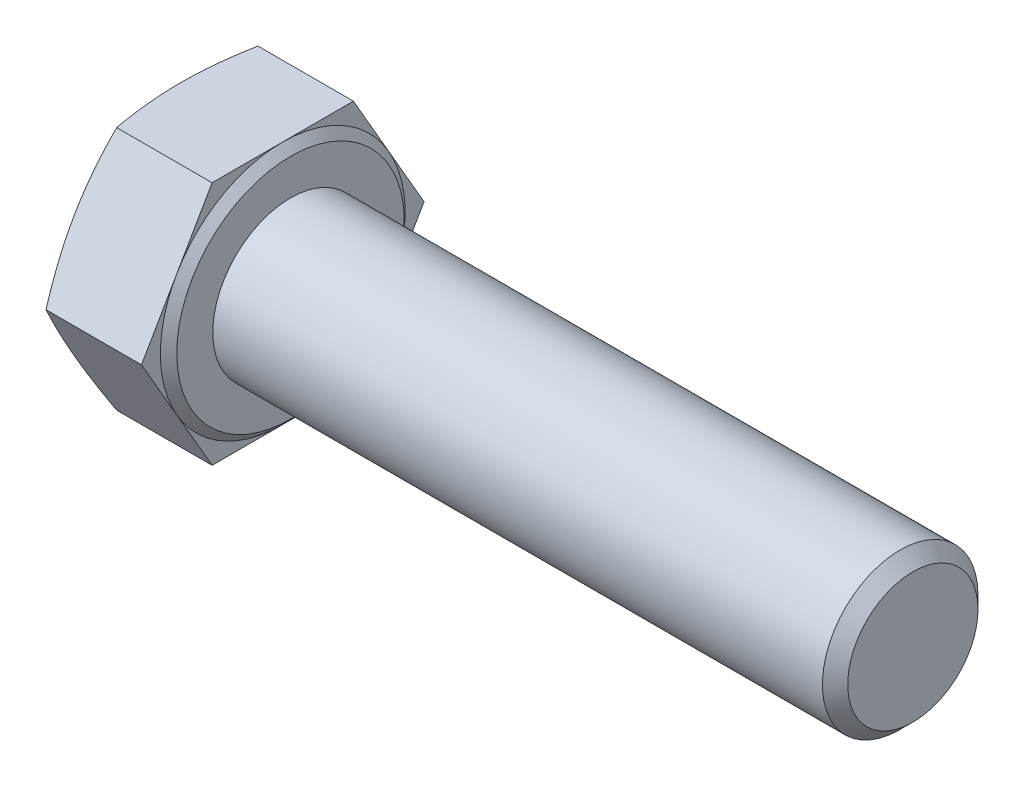
ISO-10303-21;
HEADER;
FILE_DESCRIPTION(('STEP AP214'),'2;1');
FILE_NAME('part.step','',(''),(''),'','','');
FILE_SCHEMA(('AUTOMOTIVE_DESIGN { 1 0 10303 214 1 1 1 1 }'));
ENDSEC;
DATA;
#1=APPLICATION_CONTEXT('core data for automotive mechanical design processes');
#2=APPLICATION_PROTOCOL_DEFINITION('international standard','automotive_design',2000,#1);
#3=PRODUCT_CONTEXT('',#1,'mechanical');
#4=PRODUCT('Part','Part','',(#3));
#5=PRODUCT_RELATED_PRODUCT_CATEGORY('part','',(#4));
#6=PRODUCT_DEFINITION_FORMATION('','',#4);
#7=PRODUCT_DEFINITION_CONTEXT('part definition',#1,'design');
#8=PRODUCT_DEFINITION('design','',#6,#7);
#9=PRODUCT_DEFINITION_SHAPE('','',#8);
#10=(LENGTH_UNIT() NAMED_UNIT(*) SI_UNIT(.MILLI.,.METRE.));
#11=(NAMED_UNIT(*) PLANE_ANGLE_UNIT() SI_UNIT($,.RADIAN.));
#12=(NAMED_UNIT(*) SI_UNIT($,.STERADIAN.) SOLID_ANGLE_UNIT());
#13=UNCERTAINTY_MEASURE_WITH_UNIT(LENGTH_MEASURE(1.E-05),#10,'distance_accuracy_value','');
#14=(GEOMETRIC_REPRESENTATION_CONTEXT(3) GLOBAL_UNCERTAINTY_ASSIGNED_CONTEXT((#13)) GLOBAL_UNIT_ASSIGNED_CONTEXT((#10,
#11,#12)) REPRESENTATION_CONTEXT('',''));
#15=CARTESIAN_POINT('',(0.,0.,0.));
#16=DIRECTION('',(0.,0.,1.));
#17=DIRECTION('',(1.,0.,0.));
#18=AXIS2_PLACEMENT_3D('',#15,#16,#17);
#19=CARTESIAN_POINT('',(7.08,0.,0.));
#20=DIRECTION('',(1.,0.,0.));
#21=DIRECTION('',(0.,0.,-1.));
#22=AXIS2_PLACEMENT_3D('',#19,#20,#21);
#23=PLANE('',#22);
#24=CARTESIAN_POINT('',(7.08,0.,0.));
#25=DIRECTION('',(-1.,0.,0.));
#26=DIRECTION('',(0.,0.,1.));
#27=AXIS2_PLACEMENT_3D('',#24,#25,#26);
#28=CIRCLE('',#27,7.315);
#29=CARTESIAN_POINT('',(7.08,0.,7.315));
#30=VERTEX_POINT('',#29);
#31=EDGE_CURVE('E145',#30,#30,#28,.T.);
#32=ORIENTED_EDGE('',*,*,#31,.F.);
#33=EDGE_LOOP('',(#32));
#34=FACE_BOUND('',#33,.T.);
#35=CARTESIAN_POINT('',(7.08,0.,0.));
#36=DIRECTION('',(1.,0.,0.));
#37=DIRECTION('',(0.,0.,-1.));
#38=AXIS2_PLACEMENT_3D('',#35,#36,#37);
#39=CIRCLE('',#38,5.);
#40=CARTESIAN_POINT('',(7.08,0.,-5.));
#41=VERTEX_POINT('',#40);
#42=EDGE_CURVE('E146',#41,#41,#39,.T.);
#43=ORIENTED_EDGE('',*,*,#42,.F.);
#44=EDGE_LOOP('',(#43));
#45=FACE_BOUND('',#44,.T.);
#46=ADVANCED_FACE('F41',(#34,#45),#23,.T.);
#47=CARTESIAN_POINT('',(6.58,0.,-9.08171973435282));
#48=DIRECTION('',(1.,0.,0.));
#49=DIRECTION('',(0.,0.,-1.));
#50=AXIS2_PLACEMENT_3D('',#47,#48,#49);
#51=PLANE('',#50);
#52=DIRECTION('',(0.,-0.866025403784438,0.5));
#53=VECTOR('',#52,1.);
#54=CARTESIAN_POINT('',(6.58,7.865,4.54085986717641));
#55=LINE('',#54,#53);
#56=CARTESIAN_POINT('',(6.58,7.865,4.54085986717641));
#57=VERTEX_POINT('',#56);
#58=CARTESIAN_POINT('',(6.58,3.9325,6.81128980076461));
#59=VERTEX_POINT('',#58);
#60=EDGE_CURVE('E144',#57,#59,#55,.T.);
#61=ORIENTED_EDGE('',*,*,#60,.T.);
#62=CARTESIAN_POINT('',(6.58,0.,0.));
#63=DIRECTION('',(-1.,0.,0.));
#64=DIRECTION('',(0.,0.,1.));
#65=AXIS2_PLACEMENT_3D('',#62,#63,#64);
#66=CIRCLE('',#65,7.865);
#67=CARTESIAN_POINT('',(6.58,7.865,0.));
#68=VERTEX_POINT('',#67);
#69=EDGE_CURVE('E56',#59,#68,#66,.T.);
#70=ORIENTED_EDGE('',*,*,#69,.T.);
#71=DIRECTION('',(0.,0.,1.));
#72=VECTOR('',#71,1.);
#73=CARTESIAN_POINT('',(6.58,7.865,-4.5408598671764));
#74=LINE('',#73,#72);
#75=EDGE_CURVE('E141',#68,#57,#74,.T.);
#76=ORIENTED_EDGE('',*,*,#75,.T.);
#77=EDGE_LOOP('',(#61,#70,#76));
#78=FACE_BOUND('',#77,.T.);
#79=ADVANCED_FACE('F140',(#78),#51,.T.);
#80=CARTESIAN_POINT('',(6.58,7.865,-4.5408598671764));
#81=VERTEX_POINT('',#80);
#82=EDGE_CURVE('E152',#81,#68,#74,.T.);
#83=ORIENTED_EDGE('',*,*,#82,.T.);
#84=CARTESIAN_POINT('',(6.58,3.9325,-6.8112898007646));
#85=VERTEX_POINT('',#84);
#86=EDGE_CURVE('E129',#68,#85,#66,.T.);
#87=ORIENTED_EDGE('',*,*,#86,.T.);
#88=DIRECTION('',(0.,0.866025403784438,0.5));
#89=VECTOR('',#88,1.);
#90=CARTESIAN_POINT('',(6.58,0.,-9.08171973435282));
#91=LINE('',#90,#89);
#92=EDGE_CURVE('E158',#85,#81,#91,.T.);
#93=ORIENTED_EDGE('',*,*,#92,.T.);
#94=EDGE_LOOP('',(#83,#87,#93));
#95=FACE_BOUND('',#94,.T.);
#96=ADVANCED_FACE('F157',(#95),#51,.T.);
#97=CARTESIAN_POINT('',(6.58,0.,-9.08171973435282));
#98=VERTEX_POINT('',#97);
#99=EDGE_CURVE('E155',#98,#85,#91,.T.);
#100=ORIENTED_EDGE('',*,*,#99,.T.);
#101=CARTESIAN_POINT('',(6.58,-3.9325,-6.81128980076461));
#102=VERTEX_POINT('',#101);
#103=EDGE_CURVE('E132',#85,#102,#66,.T.);
#104=ORIENTED_EDGE('',*,*,#103,.T.);
#105=DIRECTION('',(0.,0.866025403784439,-0.5));
#106=VECTOR('',#105,1.);
#107=CARTESIAN_POINT('',(6.58,-7.865,-4.54085986717641));
#108=LINE('',#107,#106);
#109=EDGE_CURVE('E303',#102,#98,#108,.T.);
#110=ORIENTED_EDGE('',*,*,#109,.T.);
#111=EDGE_LOOP('',(#100,#104,#110));
#112=FACE_BOUND('',#111,.T.);
#113=ADVANCED_FACE('F447',(#112),#51,.T.);
#114=CARTESIAN_POINT('',(6.58,-7.865,-4.54085986717641));
#115=VERTEX_POINT('',#114);
#116=EDGE_CURVE('E301',#115,#102,#108,.T.);
#117=ORIENTED_EDGE('',*,*,#116,.T.);
#118=CARTESIAN_POINT('',(6.58,-7.865,0.));
#119=VERTEX_POINT('',#118);
#120=EDGE_CURVE('E371',#102,#119,#66,.T.);
#121=ORIENTED_EDGE('',*,*,#120,.T.);
#122=DIRECTION('',(0.,0.,-1.));
#123=VECTOR('',#122,1.);
#124=CARTESIAN_POINT('',(6.58,-7.865,4.54085986717641));
#125=LINE('',#124,#123);
#126=EDGE_CURVE('E169',#119,#115,#125,.T.);
#127=ORIENTED_EDGE('',*,*,#126,.T.);
#128=EDGE_LOOP('',(#117,#121,#127));
#129=FACE_BOUND('',#128,.T.);
#130=ADVANCED_FACE('F455',(#129),#51,.T.);
#131=CARTESIAN_POINT('',(6.58,-7.865,4.54085986717641));
#132=VERTEX_POINT('',#131);
#133=EDGE_CURVE('E170',#132,#119,#125,.T.);
#134=ORIENTED_EDGE('',*,*,#133,.T.);
#135=CARTESIAN_POINT('',(6.58,-3.9325,6.81128980076461));
#136=VERTEX_POINT('',#135);
#137=EDGE_CURVE('E370',#119,#136,#66,.T.);
#138=ORIENTED_EDGE('',*,*,#137,.T.);
#139=DIRECTION('',(0.,-0.866025403784438,-0.5));
#140=VECTOR('',#139,1.);
#141=CARTESIAN_POINT('',(6.58,0.,9.08171973435282));
#142=LINE('',#141,#140);
#143=EDGE_CURVE('E165',#136,#132,#142,.T.);
#144=ORIENTED_EDGE('',*,*,#143,.T.);
#145=EDGE_LOOP('',(#134,#138,#144));
#146=FACE_BOUND('',#145,.T.);
#147=ADVANCED_FACE('F285',(#146),#51,.T.);
#148=CARTESIAN_POINT('',(6.58,0.,9.08171973435282));
#149=VERTEX_POINT('',#148);
#150=EDGE_CURVE('E166',#149,#136,#142,.T.);
#151=ORIENTED_EDGE('',*,*,#150,.T.);
#152=EDGE_CURVE('E147',#136,#59,#66,.T.);
#153=ORIENTED_EDGE('',*,*,#152,.T.);
#154=EDGE_CURVE('E160',#59,#149,#55,.T.);
#155=ORIENTED_EDGE('',*,*,#154,.T.);
#156=EDGE_LOOP('',(#151,#153,#155));
#157=FACE_BOUND('',#156,.T.);
#158=ADVANCED_FACE('F212',(#157),#51,.T.);
#159=CARTESIAN_POINT('',(6.58,-7.865,-4.54085986717641));
#160=DIRECTION('',(0.,0.5,0.866025403784439));
#161=DIRECTION('',(0.,-0.866025403784439,0.5));
#162=AXIS2_PLACEMENT_3D('',#159,#160,#161);
#163=PLANE('',#162);
#164=CARTESIAN_POINT('',(0.442891795212777,0.000199999999998242,-9.08183520440666));
#165=CARTESIAN_POINT('',(0.374419710513131,-0.325523427428622,-8.89377869589937));
#166=CARTESIAN_POINT('',(0.312132535274959,-0.65232094011057,-8.70510206398195));
#167=CARTESIAN_POINT('',(0.202547931744523,-1.30804080665139,-8.32652202252162));
#168=CARTESIAN_POINT('',(0.155262232707484,-1.63696461899395,-8.13661777092277));
#169=CARTESIAN_POINT('',(0.0787789851506867,-2.29328683840491,-7.75768996087072));
#170=CARTESIAN_POINT('',(0.0494146172511894,-2.62067025705745,-7.56867505598345));
#171=CARTESIAN_POINT('',(0.0100287510814296,-3.27620267267748,-7.1902032393627));
#172=CARTESIAN_POINT('',(0.,-3.60435133633874,-7.00074652006366));
#173=CARTESIAN_POINT('',(0.,-4.26064866366126,-6.62183308146557));
#174=CARTESIAN_POINT('',(0.0100287510814295,-4.58879732732252,-6.43237636216653));
#175=CARTESIAN_POINT('',(0.0494146172511887,-5.24432974294255,-6.05390454554577));
#176=CARTESIAN_POINT('',(0.0787789851506854,-5.57171316159509,-5.86488964065851));
#177=CARTESIAN_POINT('',(0.155262232707483,-6.22803538100605,-5.48596183060646));
#178=CARTESIAN_POINT('',(0.202547931744522,-6.55695919334861,-5.2960575790076));
#179=CARTESIAN_POINT('',(0.312132535274959,-7.21267905988943,-4.91747753754728));
#180=CARTESIAN_POINT('',(0.374419710513131,-7.53947657257138,-4.72880090562985));
#181=CARTESIAN_POINT('',(0.442891795212775,-7.8652,-4.54074439712257));
#182=B_SPLINE_CURVE_WITH_KNOTS('',3,(#164,#165,#166,#167,#168,#169,#170,#171,#172,#173,#174,
#175,#176,#177,#178,#179,#180,#181),.UNSPECIFIED.,.F.,.F.,(4,2,2,2,2,2,2,2,4),(0.,
1.14700314621245,2.29490090600088,3.43194374910872,4.56856000315232,5.70517625719591,
6.84221910030375,7.99011686009218,9.13712000630463),.UNSPECIFIED.);
#183=CARTESIAN_POINT('',(0.442849766748696,0.,-9.08171973435282));
#184=VERTEX_POINT('',#183);
#185=CARTESIAN_POINT('',(0.,-3.9325,-6.81128980076461));
#186=VERTEX_POINT('',#185);
#187=EDGE_CURVE('E291',#184,#186,#182,.T.);
#188=ORIENTED_EDGE('',*,*,#187,.F.);
#189=DIRECTION('',(-1.,0.,0.));
#190=VECTOR('',#189,1.);
#191=CARTESIAN_POINT('',(6.58,0.,-9.08171973435282));
#192=LINE('',#191,#190);
#193=EDGE_CURVE('E185',#98,#184,#192,.T.);
#194=ORIENTED_EDGE('',*,*,#193,.F.);
#195=ORIENTED_EDGE('',*,*,#109,.F.);
#196=ORIENTED_EDGE('',*,*,#116,.F.);
#197=DIRECTION('',(-1.,0.,0.));
#198=VECTOR('',#197,1.);
#199=CARTESIAN_POINT('',(6.58,-7.865,-4.54085986717641));
#200=LINE('',#199,#198);
#201=CARTESIAN_POINT('',(0.442849766748696,-7.865,-4.54085986717642));
#202=VERTEX_POINT('',#201);
#203=EDGE_CURVE('E173',#115,#202,#200,.T.);
#204=ORIENTED_EDGE('',*,*,#203,.T.);
#205=EDGE_CURVE('E247',#186,#202,#182,.T.);
#206=ORIENTED_EDGE('',*,*,#205,.F.);
#207=EDGE_LOOP('',(#188,#194,#195,#196,#204,#206));
#208=FACE_BOUND('',#207,.T.);
#209=ADVANCED_FACE('F276',(#208),#163,.F.);
#210=CARTESIAN_POINT('',(6.58,0.,-9.08171973435282));
#211=DIRECTION('',(0.,-0.5,0.866025403784438));
#212=DIRECTION('',(0.,-0.866025403784438,-0.5));
#213=AXIS2_PLACEMENT_3D('',#210,#211,#212);
#214=PLANE('',#213);
#215=CARTESIAN_POINT('',(0.442891795212775,7.8652,-4.54074439712256));
#216=CARTESIAN_POINT('',(0.37441971051313,7.53947657257138,-4.72880090562985));
#217=CARTESIAN_POINT('',(0.312132535274958,7.21267905988943,-4.91747753754727));
#218=CARTESIAN_POINT('',(0.202547931744522,6.55695919334862,-5.2960575790076));
#219=CARTESIAN_POINT('',(0.155262232707482,6.22803538100606,-5.48596183060645));
#220=CARTESIAN_POINT('',(0.0787789851506846,5.57171316159509,-5.86488964065851));
#221=CARTESIAN_POINT('',(0.0494146172511877,5.24432974294255,-6.05390454554577));
#222=CARTESIAN_POINT('',(0.0100287510814281,4.58879732732252,-6.43237636216652));
#223=CARTESIAN_POINT('',(0.,4.26064866366126,-6.62183308146557));
#224=CARTESIAN_POINT('',(0.,3.60435133633874,-7.00074652006365));
#225=CARTESIAN_POINT('',(0.0100287510814286,3.27620267267748,-7.1902032393627));
#226=CARTESIAN_POINT('',(0.0494146172511884,2.62067025705745,-7.56867505598345));
#227=CARTESIAN_POINT('',(0.0787789851506852,2.29328683840491,-7.75768996087071));
#228=CARTESIAN_POINT('',(0.155262232707483,1.63696461899394,-8.13661777092277));
#229=CARTESIAN_POINT('',(0.202547931744522,1.30804080665138,-8.32652202252162));
#230=CARTESIAN_POINT('',(0.312132535274959,0.652320940110566,-8.70510206398195));
#231=CARTESIAN_POINT('',(0.374419710513131,0.325523427428617,-8.89377869589937));
#232=CARTESIAN_POINT('',(0.442891795212777,-0.000200000000002815,-9.08183520440666));
#233=B_SPLINE_CURVE_WITH_KNOTS('',3,(#215,#216,#217,#218,#219,#220,#221,#222,#223,#224,#225,
#226,#227,#228,#229,#230,#231,#232),.UNSPECIFIED.,.F.,.F.,(4,2,2,2,2,2,2,2,4),(0.,
1.14700314621245,2.29490090600088,3.43194374910873,4.56856000315232,5.70517625719592,
6.84221910030376,7.99011686009219,9.13712000630464),.UNSPECIFIED.);
#234=CARTESIAN_POINT('',(0.442849766748696,7.865,-4.54085986717641));
#235=VERTEX_POINT('',#234);
#236=CARTESIAN_POINT('',(0.,3.9325,-6.81128980076461));
#237=VERTEX_POINT('',#236);
#238=EDGE_CURVE('E266',#235,#237,#233,.T.);
#239=ORIENTED_EDGE('',*,*,#238,.F.);
#240=DIRECTION('',(-1.,0.,0.));
#241=VECTOR('',#240,1.);
#242=CARTESIAN_POINT('',(6.58,7.865,-4.5408598671764));
#243=LINE('',#242,#241);
#244=EDGE_CURVE('E183',#81,#235,#243,.T.);
#245=ORIENTED_EDGE('',*,*,#244,.F.);
#246=ORIENTED_EDGE('',*,*,#92,.F.);
#247=ORIENTED_EDGE('',*,*,#99,.F.);
#248=ORIENTED_EDGE('',*,*,#193,.T.);
#249=EDGE_CURVE('E260',#237,#184,#233,.T.);
#250=ORIENTED_EDGE('',*,*,#249,.F.);
#251=EDGE_LOOP('',(#239,#245,#246,#247,#248,#250));
#252=FACE_BOUND('',#251,.T.);
#253=ADVANCED_FACE('F273',(#252),#214,.F.);
#254=CARTESIAN_POINT('',(6.58,7.865,-4.5408598671764));
#255=DIRECTION('',(0.,-1.,0.));
#256=DIRECTION('',(0.,0.,-1.));
#257=AXIS2_PLACEMENT_3D('',#254,#255,#256);
#258=PLANE('',#257);
#259=CARTESIAN_POINT('',(2.36641352883533,7.865,-12.0226002521994));
#260=CARTESIAN_POINT('',(2.25806006653459,7.865,-11.6667592108969));
#261=CARTESIAN_POINT('',(2.15097094806914,7.865,-11.3105260197279));
#262=CARTESIAN_POINT('',(1.94002083195681,7.865,-10.5970756919498));
#263=CARTESIAN_POINT('',(1.83616008975262,7.865,-10.2398584799029));
#264=CARTESIAN_POINT('',(1.63219338793845,7.865,-9.52362904909048));
#265=CARTESIAN_POINT('',(1.53209479535906,7.865,-9.16461472477211));
#266=CARTESIAN_POINT('',(1.33682427451146,7.865,-8.44525058341011));
#267=CARTESIAN_POINT('',(1.24165225778544,7.865,-8.0849007904697));
#268=CARTESIAN_POINT('',(1.0585905385423,7.865,-7.36707846156646));
#269=CARTESIAN_POINT('',(0.970625516530096,7.865,-7.00962522951278));
#270=CARTESIAN_POINT('',(0.802184639608975,7.865,-6.29294003205344));
#271=CARTESIAN_POINT('',(0.721708910733724,7.865,-5.93370803682097));
#272=CARTESIAN_POINT('',(0.57012283656526,7.865,-5.21338493122038));
#273=CARTESIAN_POINT('',(0.499009296610733,7.865,-4.85229449893847));
#274=CARTESIAN_POINT('',(0.368312985121941,7.865,-4.12801725415188));
#275=CARTESIAN_POINT('',(0.308729827253167,7.865,-3.76483051230575));
#276=CARTESIAN_POINT('',(0.209414441038813,7.865,-3.07725690165156));
#277=CARTESIAN_POINT('',(0.168205546214481,7.865,-2.75308533282619));
#278=CARTESIAN_POINT('',(0.0984487044914571,7.865,-2.10337143697526));
#279=CARTESIAN_POINT('',(0.0699003886504234,7.865,-1.77782915017295));
#280=CARTESIAN_POINT('',(0.0268395333928625,7.865,-1.1260341381528));
#281=CARTESIAN_POINT('',(0.0123170662625511,7.865,-0.799782079500943));
#282=CARTESIAN_POINT('',(-0.00195682196202641,7.865,-0.146951554097975));
#283=CARTESIAN_POINT('',(-0.00170834736825149,7.865,0.179626910331782));
#284=CARTESIAN_POINT('',(0.0135848305907241,7.865,0.834088605803923));
#285=CARTESIAN_POINT('',(0.0287045666873489,7.865,1.16197005432891));
#286=CARTESIAN_POINT('',(0.0730444535855849,7.865,1.81676988175853));
#287=CARTESIAN_POINT('',(0.10226494314847,7.865,2.14368823733564));
#288=CARTESIAN_POINT('',(0.173439416526266,7.865,2.79640045175947));
#289=CARTESIAN_POINT('',(0.215404337365143,7.865,3.12219310070865));
#290=CARTESIAN_POINT('',(0.310365462203545,7.865,3.77214853671124));
#291=CARTESIAN_POINT('',(0.363361725327742,7.865,4.09631131501949));
#292=CARTESIAN_POINT('',(0.481710366049261,7.865,4.76006524207305));
#293=CARTESIAN_POINT('',(0.547568048319132,7.865,5.09956549095026));
#294=CARTESIAN_POINT('',(0.687759691368541,7.865,5.77682257574968));
#295=CARTESIAN_POINT('',(0.762094291182788,7.865,6.11457927822533));
#296=CARTESIAN_POINT('',(0.91767888921197,7.865,6.78858995476072));
#297=CARTESIAN_POINT('',(0.998930895809681,7.865,7.12484346235698));
#298=CARTESIAN_POINT('',(1.16702859371564,7.865,7.7959339873515));
#299=CARTESIAN_POINT('',(1.25387415094818,7.865,8.13077103849691));
#300=CARTESIAN_POINT('',(1.43222777068835,7.865,8.79965725830403));
#301=CARTESIAN_POINT('',(1.52374167778338,7.865,9.13370486288186));
#302=CARTESIAN_POINT('',(1.71049239515709,7.865,9.80075635699058));
#303=CARTESIAN_POINT('',(1.80572922122974,7.865,10.1337602420872));
#304=CARTESIAN_POINT('',(1.99924297662574,7.865,10.7988194802628));
#305=CARTESIAN_POINT('',(2.09751937989521,7.865,11.1308749867298));
#306=CARTESIAN_POINT('',(2.29660417636339,7.865,11.7942269637766));
#307=CARTESIAN_POINT('',(2.39741258611677,7.865,12.1255234293784));
#308=CARTESIAN_POINT('',(2.70073124187539,7.865,13.1111316113962));
#309=CARTESIAN_POINT('',(2.90629348400979,7.865,13.7645038967645));
#310=CARTESIAN_POINT('',(3.32324319611831,7.865,15.0694121850919));
#311=CARTESIAN_POINT('',(3.53463094557801,7.865,15.7209480982901));
#312=CARTESIAN_POINT('',(3.96086805240708,7.865,17.0201471473339));
#313=CARTESIAN_POINT('',(4.17570123192526,7.865,17.6678155976447));
#314=CARTESIAN_POINT('',(4.50033413441195,7.865,18.6384901456375));
#315=CARTESIAN_POINT('',(4.60893786794371,7.865,18.9618972960534));
#316=CARTESIAN_POINT('',(4.82684807618741,7.865,19.6084739186475));
#317=CARTESIAN_POINT('',(4.93615454918639,7.865,19.9316433914029));
#318=CARTESIAN_POINT('',(5.04576544996387,7.865,20.2547096296475));
#319=B_SPLINE_CURVE_WITH_KNOTS('',3,(#259,#260,#261,#262,#263,#264,#265,#266,#267,#268,#269,
#270,#271,#272,#273,#274,#275,#276,#277,#278,#279,#280,#281,#282,#283,#284,#285,#286,#287,#288,
#289,#290,#291,#292,#293,#294,#295,#296,#297,#298,#299,#300,#301,#302,#303,#304,#305,#306,#307,
#308,#309,#310,#311,#312,#313,#314,#315,#316,#317,#318),.UNSPECIFIED.,.F.,.F.,(4,2,2,2,2,2,2,2,
2,2,2,2,2,2,2,2,2,2,2,2,2,2,2,2,2,2,2,2,2,4),(0.,1.11592451335134,2.23193709973416,
3.35003188749546,4.46810659263983,5.5723960125604,6.67670401267008,7.78063420744246,
8.88452740776003,9.86465314915734,10.8447503268016,11.8241532668998,12.8035492904839,
13.7879123241796,14.7722990077235,15.7575328715573,16.7427720160839,17.78012614953,
18.8175585359564,19.8552931619037,20.8930029229185,21.932045362512,22.971092210578,
24.0099602280774,25.0488350396308,27.1036289647327,29.1585216432028,31.2056173678941,
32.2290827778725,33.2525456940576),.UNSPECIFIED.);
#320=CARTESIAN_POINT('',(0.442849766748698,7.86500000000001,4.5408598671764));
#321=VERTEX_POINT('',#320);
#322=CARTESIAN_POINT('',(0.,7.865,0.));
#323=VERTEX_POINT('',#322);
#324=EDGE_CURVE('E64',#321,#323,#319,.F.);
#325=ORIENTED_EDGE('',*,*,#324,.F.);
#326=DIRECTION('',(-1.,0.,0.));
#327=VECTOR('',#326,1.);
#328=CARTESIAN_POINT('',(6.58,7.865,4.54085986717641));
#329=LINE('',#328,#327);
#330=EDGE_CURVE('E154',#57,#321,#329,.T.);
#331=ORIENTED_EDGE('',*,*,#330,.F.);
#332=ORIENTED_EDGE('',*,*,#75,.F.);
#333=ORIENTED_EDGE('',*,*,#82,.F.);
#334=ORIENTED_EDGE('',*,*,#244,.T.);
#335=EDGE_CURVE('E267',#323,#235,#319,.F.);
#336=ORIENTED_EDGE('',*,*,#335,.F.);
#337=EDGE_LOOP('',(#325,#331,#332,#333,#334,#336));
#338=FACE_BOUND('',#337,.T.);
#339=ADVANCED_FACE('F150',(#338),#258,.F.);
#340=CARTESIAN_POINT('',(6.58,7.865,4.54085986717641));
#341=DIRECTION('',(0.,-0.5,-0.866025403784439));
#342=DIRECTION('',(0.,0.866025403784439,-0.5));
#343=AXIS2_PLACEMENT_3D('',#340,#341,#342);
#344=PLANE('',#343);
#345=CARTESIAN_POINT('',(0.442891795212778,-0.000199999999999959,9.08183520440666));
#346=CARTESIAN_POINT('',(0.374419710513132,0.325523427428621,8.89377869589937));
#347=CARTESIAN_POINT('',(0.31213253527496,0.652320940110569,8.70510206398195));
#348=CARTESIAN_POINT('',(0.202547931744523,1.30804080665139,8.32652202252162));
#349=CARTESIAN_POINT('',(0.155262232707485,1.63696461899394,8.13661777092277));
#350=CARTESIAN_POINT('',(0.0787789851506868,2.29328683840491,7.75768996087072));
#351=CARTESIAN_POINT('',(0.0494146172511895,2.62067025705745,7.56867505598345));
#352=CARTESIAN_POINT('',(0.0100287510814296,3.27620267267748,7.1902032393627));
#353=CARTESIAN_POINT('',(0.,3.60435133633874,7.00074652006365));
#354=CARTESIAN_POINT('',(0.,4.26064866366126,6.62183308146557));
#355=CARTESIAN_POINT('',(0.0100287510814295,4.58879732732252,6.43237636216652));
#356=CARTESIAN_POINT('',(0.0494146172511891,5.24432974294256,6.05390454554577));
#357=CARTESIAN_POINT('',(0.0787789851506861,5.57171316159509,5.86488964065851));
#358=CARTESIAN_POINT('',(0.155262232707484,6.22803538100606,5.48596183060645));
#359=CARTESIAN_POINT('',(0.202547931744523,6.55695919334862,5.2960575790076));
#360=CARTESIAN_POINT('',(0.31213253527496,7.21267905988944,4.91747753754727));
#361=CARTESIAN_POINT('',(0.374419710513131,7.53947657257138,4.72880090562985));
#362=CARTESIAN_POINT('',(0.442891795212777,7.8652,4.54074439712257));
#363=B_SPLINE_CURVE_WITH_KNOTS('',3,(#345,#346,#347,#348,#349,#350,#351,#352,#353,#354,#355,
#356,#357,#358,#359,#360,#361,#362),.UNSPECIFIED.,.F.,.F.,(4,2,2,2,2,2,2,2,4),(0.,
1.14700314621245,2.29490090600088,3.43194374910873,4.56856000315232,5.70517625719592,
6.84221910030376,7.99011686009219,9.13712000630464),.UNSPECIFIED.);
#364=CARTESIAN_POINT('',(0.442849766748698,0.,9.08171973435282));
#365=VERTEX_POINT('',#364);
#366=CARTESIAN_POINT('',(0.,3.9325,6.81128980076461));
#367=VERTEX_POINT('',#366);
#368=EDGE_CURVE('E253',#365,#367,#363,.T.);
#369=ORIENTED_EDGE('',*,*,#368,.F.);
#370=DIRECTION('',(-1.,0.,0.));
#371=VECTOR('',#370,1.);
#372=CARTESIAN_POINT('',(6.58,0.,9.08171973435282));
#373=LINE('',#372,#371);
#374=EDGE_CURVE('E179',#149,#365,#373,.T.);
#375=ORIENTED_EDGE('',*,*,#374,.F.);
#376=ORIENTED_EDGE('',*,*,#154,.F.);
#377=ORIENTED_EDGE('',*,*,#60,.F.);
#378=ORIENTED_EDGE('',*,*,#330,.T.);
#379=EDGE_CURVE('E307',#367,#321,#363,.T.);
#380=ORIENTED_EDGE('',*,*,#379,.F.);
#381=EDGE_LOOP('',(#369,#375,#376,#377,#378,#380));
#382=FACE_BOUND('',#381,.T.);
#383=ADVANCED_FACE('F356',(#382),#344,.F.);
#384=CARTESIAN_POINT('',(6.58,0.,9.08171973435282));
#385=DIRECTION('',(0.,0.5,-0.866025403784438));
#386=DIRECTION('',(0.,0.866025403784438,0.5));
#387=AXIS2_PLACEMENT_3D('',#384,#385,#386);
#388=PLANE('',#387);
#389=CARTESIAN_POINT('',(0.442891795212775,-7.8652,4.54074439712257));
#390=CARTESIAN_POINT('',(0.37441971051313,-7.53947657257138,4.72880090562985));
#391=CARTESIAN_POINT('',(0.312132535274959,-7.21267905988943,4.91747753754727));
#392=CARTESIAN_POINT('',(0.202547931744522,-6.55695919334861,5.2960575790076));
#393=CARTESIAN_POINT('',(0.155262232707483,-6.22803538100605,5.48596183060646));
#394=CARTESIAN_POINT('',(0.0787789851506855,-5.57171316159509,5.86488964065851));
#395=CARTESIAN_POINT('',(0.0494146172511885,-5.24432974294255,6.05390454554577));
#396=CARTESIAN_POINT('',(0.0100287510814291,-4.58879732732251,6.43237636216652));
#397=CARTESIAN_POINT('',(0.,-4.26064866366126,6.62183308146557));
#398=CARTESIAN_POINT('',(0.,-3.60435133633874,7.00074652006366));
#399=CARTESIAN_POINT('',(0.0100287510814296,-3.27620267267748,7.1902032393627));
#400=CARTESIAN_POINT('',(0.0494146172511893,-2.62067025705744,7.56867505598345));
#401=CARTESIAN_POINT('',(0.0787789851506864,-2.29328683840491,7.75768996087072));
#402=CARTESIAN_POINT('',(0.155262232707484,-1.63696461899394,8.13661777092277));
#403=CARTESIAN_POINT('',(0.202547931744523,-1.30804080665138,8.32652202252162));
#404=CARTESIAN_POINT('',(0.31213253527496,-0.652320940110567,8.70510206398195));
#405=CARTESIAN_POINT('',(0.374419710513132,-0.325523427428618,8.89377869589937));
#406=CARTESIAN_POINT('',(0.442891795212778,0.000200000000001899,9.08183520440666));
#407=B_SPLINE_CURVE_WITH_KNOTS('',3,(#389,#390,#391,#392,#393,#394,#395,#396,#397,#398,#399,
#400,#401,#402,#403,#404,#405,#406),.UNSPECIFIED.,.F.,.F.,(4,2,2,2,2,2,2,2,4),(0.,
1.14700314621245,2.29490090600088,3.43194374910872,4.56856000315232,5.70517625719591,
6.84221910030376,7.99011686009219,9.13712000630464),.UNSPECIFIED.);
#408=CARTESIAN_POINT('',(0.442849766748698,-7.865,4.54085986717643));
#409=VERTEX_POINT('',#408);
#410=CARTESIAN_POINT('',(0.,-3.93250000000001,6.81128980076461));
#411=VERTEX_POINT('',#410);
#412=EDGE_CURVE('E239',#409,#411,#407,.T.);
#413=ORIENTED_EDGE('',*,*,#412,.F.);
#414=DIRECTION('',(-1.,0.,0.));
#415=VECTOR('',#414,1.);
#416=CARTESIAN_POINT('',(6.58,-7.865,4.54085986717641));
#417=LINE('',#416,#415);
#418=EDGE_CURVE('E176',#132,#409,#417,.T.);
#419=ORIENTED_EDGE('',*,*,#418,.F.);
#420=ORIENTED_EDGE('',*,*,#143,.F.);
#421=ORIENTED_EDGE('',*,*,#150,.F.);
#422=ORIENTED_EDGE('',*,*,#374,.T.);
#423=EDGE_CURVE('E295',#411,#365,#407,.T.);
#424=ORIENTED_EDGE('',*,*,#423,.F.);
#425=EDGE_LOOP('',(#413,#419,#420,#421,#422,#424));
#426=FACE_BOUND('',#425,.T.);
#427=ADVANCED_FACE('F352',(#426),#388,.F.);
#428=CARTESIAN_POINT('',(6.58,-7.865,4.54085986717641));
#429=DIRECTION('',(0.,1.,0.));
#430=DIRECTION('',(0.,0.,1.));
#431=AXIS2_PLACEMENT_3D('',#428,#429,#430);
#432=PLANE('',#431);
#433=CARTESIAN_POINT('',(2.36641352883533,-7.865,-12.0226002521994));
#434=CARTESIAN_POINT('',(2.25806006653459,-7.865,-11.6667592108969));
#435=CARTESIAN_POINT('',(2.15097094806914,-7.865,-11.3105260197279));
#436=CARTESIAN_POINT('',(1.94002083195681,-7.865,-10.5970756919498));
#437=CARTESIAN_POINT('',(1.83616008975262,-7.865,-10.2398584799029));
#438=CARTESIAN_POINT('',(1.63219338793846,-7.865,-9.52362904909049));
#439=CARTESIAN_POINT('',(1.53209479535907,-7.865,-9.16461472477212));
#440=CARTESIAN_POINT('',(1.33682427451146,-7.865,-8.44525058341012));
#441=CARTESIAN_POINT('',(1.24165225778545,-7.865,-8.08490079046971));
#442=CARTESIAN_POINT('',(1.0585905385423,-7.865,-7.36707846156647));
#443=CARTESIAN_POINT('',(0.970625516530097,-7.865,-7.00962522951279));
#444=CARTESIAN_POINT('',(0.802184639608976,-7.865,-6.29294003205345));
#445=CARTESIAN_POINT('',(0.721708910733725,-7.865,-5.93370803682097));
#446=CARTESIAN_POINT('',(0.57012283656526,-7.865,-5.21338493122039));
#447=CARTESIAN_POINT('',(0.499009296610733,-7.865,-4.85229449893848));
#448=CARTESIAN_POINT('',(0.36831298512194,-7.865,-4.12801725415188));
#449=CARTESIAN_POINT('',(0.308729827253167,-7.865,-3.76483051230575));
#450=CARTESIAN_POINT('',(0.209414441038812,-7.865,-3.07725690165157));
#451=CARTESIAN_POINT('',(0.16820554621448,-7.865,-2.7530853328262));
#452=CARTESIAN_POINT('',(0.0984487044914562,-7.865,-2.10337143697526));
#453=CARTESIAN_POINT('',(0.0699003886504223,-7.865,-1.77782915017295));
#454=CARTESIAN_POINT('',(0.026839533392861,-7.865,-1.12603413815281));
#455=CARTESIAN_POINT('',(0.0123170662625493,-7.865,-0.799782079500949));
#456=CARTESIAN_POINT('',(-0.00195682196202839,-7.865,-0.14695155409798));
#457=CARTESIAN_POINT('',(-0.00170834736825343,-7.865,0.179626910331776));
#458=CARTESIAN_POINT('',(0.0135848305907222,-7.865,0.834088605803917));
#459=CARTESIAN_POINT('',(0.0287045666873472,-7.865,1.1619700543289));
#460=CARTESIAN_POINT('',(0.0730444535855829,-7.865,1.81676988175852));
#461=CARTESIAN_POINT('',(0.102264943148468,-7.865,2.14368823733563));
#462=CARTESIAN_POINT('',(0.173439416526263,-7.865,2.79640045175946));
#463=CARTESIAN_POINT('',(0.215404337365141,-7.865,3.12219310070865));
#464=CARTESIAN_POINT('',(0.310365462203542,-7.865,3.77214853671124));
#465=CARTESIAN_POINT('',(0.363361725327739,-7.865,4.09631131501949));
#466=CARTESIAN_POINT('',(0.481710366049258,-7.865,4.76006524207304));
#467=CARTESIAN_POINT('',(0.547568048319129,-7.865,5.09956549095025));
#468=CARTESIAN_POINT('',(0.687759691368539,-7.865,5.77682257574967));
#469=CARTESIAN_POINT('',(0.762094291182786,-7.865,6.11457927822533));
#470=CARTESIAN_POINT('',(0.917678889211968,-7.865,6.78858995476071));
#471=CARTESIAN_POINT('',(0.998930895809678,-7.865,7.12484346235698));
#472=CARTESIAN_POINT('',(1.16702859371564,-7.865,7.79593398735149));
#473=CARTESIAN_POINT('',(1.25387415094818,-7.865,8.1307710384969));
#474=CARTESIAN_POINT('',(1.43222777068835,-7.865,8.79965725830403));
#475=CARTESIAN_POINT('',(1.52374167778338,-7.865,9.13370486288186));
#476=CARTESIAN_POINT('',(1.71049239515709,-7.865,9.80075635699058));
#477=CARTESIAN_POINT('',(1.80572922122974,-7.865,10.1337602420872));
#478=CARTESIAN_POINT('',(1.99924297662574,-7.865,10.7988194802628));
#479=CARTESIAN_POINT('',(2.09751937989521,-7.865,11.1308749867298));
#480=CARTESIAN_POINT('',(2.29660417636339,-7.865,11.7942269637766));
#481=CARTESIAN_POINT('',(2.39741258611677,-7.865,12.1255234293784));
#482=CARTESIAN_POINT('',(2.70073124187539,-7.865,13.1111316113962));
#483=CARTESIAN_POINT('',(2.90629348400979,-7.865,13.7645038967645));
#484=CARTESIAN_POINT('',(3.32324319611831,-7.865,15.0694121850919));
#485=CARTESIAN_POINT('',(3.53463094557802,-7.865,15.7209480982901));
#486=CARTESIAN_POINT('',(3.96086805240708,-7.865,17.0201471473339));
#487=CARTESIAN_POINT('',(4.17570123192526,-7.865,17.6678155976447));
#488=CARTESIAN_POINT('',(4.50033413441195,-7.865,18.6384901456375));
#489=CARTESIAN_POINT('',(4.60893786794372,-7.865,18.9618972960534));
#490=CARTESIAN_POINT('',(4.82684807618741,-7.865,19.6084739186475));
#491=CARTESIAN_POINT('',(4.93615454918639,-7.865,19.9316433914029));
#492=CARTESIAN_POINT('',(5.04576544996388,-7.865,20.2547096296475));
#493=B_SPLINE_CURVE_WITH_KNOTS('',3,(#433,#434,#435,#436,#437,#438,#439,#440,#441,#442,#443,
#444,#445,#446,#447,#448,#449,#450,#451,#452,#453,#454,#455,#456,#457,#458,#459,#460,#461,#462,
#463,#464,#465,#466,#467,#468,#469,#470,#471,#472,#473,#474,#475,#476,#477,#478,#479,#480,#481,
#482,#483,#484,#485,#486,#487,#488,#489,#490,#491,#492),.UNSPECIFIED.,.F.,.F.,(4,2,2,2,2,2,2,2,
2,2,2,2,2,2,2,2,2,2,2,2,2,2,2,2,2,2,2,2,2,4),(0.,1.11592451335134,2.23193709973416,
3.35003188749545,4.46810659263983,5.57239601256039,6.67670401267008,7.78063420744246,
8.88452740776003,9.86465314915734,10.8447503268016,11.8241532668998,12.8035492904839,
13.7879123241796,14.7722990077235,15.7575328715573,16.7427720160839,17.78012614953,
18.8175585359564,19.8552931619037,20.8930029229185,21.9320453625121,22.971092210578,
24.0099602280774,25.0488350396308,27.1036289647327,29.1585216432028,31.2056173678942,
32.2290827778725,33.2525456940577),.UNSPECIFIED.);
#494=CARTESIAN_POINT('',(0.,-7.86499999999999,0.));
#495=VERTEX_POINT('',#494);
#496=EDGE_CURVE('E315',#202,#495,#493,.T.);
#497=ORIENTED_EDGE('',*,*,#496,.F.);
#498=ORIENTED_EDGE('',*,*,#203,.F.);
#499=ORIENTED_EDGE('',*,*,#126,.F.);
#500=ORIENTED_EDGE('',*,*,#133,.F.);
#501=ORIENTED_EDGE('',*,*,#418,.T.);
#502=EDGE_CURVE('E228',#495,#409,#493,.T.);
#503=ORIENTED_EDGE('',*,*,#502,.F.);
#504=EDGE_LOOP('',(#497,#498,#499,#500,#501,#503));
#505=FACE_BOUND('',#504,.T.);
#506=ADVANCED_FACE('F349',(#505),#432,.F.);
#507=CARTESIAN_POINT('',(0.,0.,0.));
#508=DIRECTION('',(1.,0.,0.));
#509=DIRECTION('',(0.,0.,-1.));
#510=AXIS2_PLACEMENT_3D('',#507,#508,#509);
#511=CONICAL_SURFACE('',#510,7.865,1.22173047639604);
#512=ORIENTED_EDGE('',*,*,#249,.T.);
#513=ORIENTED_EDGE('',*,*,#187,.T.);
#514=CARTESIAN_POINT('',(0.,0.,0.));
#515=DIRECTION('',(1.,0.,0.));
#516=DIRECTION('',(0.,0.,-1.));
#517=AXIS2_PLACEMENT_3D('',#514,#515,#516);
#518=CIRCLE('',#517,7.865);
#519=EDGE_CURVE('E188',#186,#237,#518,.T.);
#520=ORIENTED_EDGE('',*,*,#519,.T.);
#521=EDGE_LOOP('',(#512,#513,#520));
#522=FACE_BOUND('',#521,.T.);
#523=ADVANCED_FACE('F348',(#522),#511,.T.);
#524=ORIENTED_EDGE('',*,*,#205,.T.);
#525=ORIENTED_EDGE('',*,*,#496,.T.);
#526=EDGE_CURVE('E190',#495,#186,#518,.T.);
#527=ORIENTED_EDGE('',*,*,#526,.T.);
#528=EDGE_LOOP('',(#524,#525,#527));
#529=FACE_BOUND('',#528,.T.);
#530=ADVANCED_FACE('F375',(#529),#511,.T.);
#531=ORIENTED_EDGE('',*,*,#412,.T.);
#532=EDGE_CURVE('E373',#411,#495,#518,.T.);
#533=ORIENTED_EDGE('',*,*,#532,.T.);
#534=ORIENTED_EDGE('',*,*,#502,.T.);
#535=EDGE_LOOP('',(#531,#533,#534));
#536=FACE_BOUND('',#535,.T.);
#537=ADVANCED_FACE('F223',(#536),#511,.T.);
#538=ORIENTED_EDGE('',*,*,#368,.T.);
#539=EDGE_CURVE('E372',#367,#411,#518,.T.);
#540=ORIENTED_EDGE('',*,*,#539,.T.);
#541=ORIENTED_EDGE('',*,*,#423,.T.);
#542=EDGE_LOOP('',(#538,#540,#541));
#543=FACE_BOUND('',#542,.T.);
#544=ADVANCED_FACE('F222',(#543),#511,.T.);
#545=ORIENTED_EDGE('',*,*,#324,.T.);
#546=CARTESIAN_POINT('',(0.,0.,0.));
#547=DIRECTION('',(-1.,0.,0.));
#548=DIRECTION('',(0.,0.,1.));
#549=AXIS2_PLACEMENT_3D('',#546,#547,#548);
#550=CIRCLE('',#549,7.865);
#551=EDGE_CURVE('E323',#367,#323,#550,.T.);
#552=ORIENTED_EDGE('',*,*,#551,.F.);
#553=ORIENTED_EDGE('',*,*,#379,.T.);
#554=EDGE_LOOP('',(#545,#552,#553));
#555=FACE_BOUND('',#554,.T.);
#556=ADVANCED_FACE('F218',(#555),#511,.T.);
#557=ORIENTED_EDGE('',*,*,#335,.T.);
#558=ORIENTED_EDGE('',*,*,#238,.T.);
#559=EDGE_CURVE('E191',#237,#323,#518,.T.);
#560=ORIENTED_EDGE('',*,*,#559,.T.);
#561=EDGE_LOOP('',(#557,#558,#560));
#562=FACE_BOUND('',#561,.T.);
#563=ADVANCED_FACE('F221',(#562),#511,.T.);
#564=CARTESIAN_POINT('',(0.,0.,-9.08171973435282));
#565=DIRECTION('',(1.,0.,0.));
#566=DIRECTION('',(0.,0.,-1.));
#567=AXIS2_PLACEMENT_3D('',#564,#565,#566);
#568=PLANE('',#567);
#569=ORIENTED_EDGE('',*,*,#559,.F.);
#570=ORIENTED_EDGE('',*,*,#519,.F.);
#571=ORIENTED_EDGE('',*,*,#526,.F.);
#572=ORIENTED_EDGE('',*,*,#532,.F.);
#573=ORIENTED_EDGE('',*,*,#539,.F.);
#574=ORIENTED_EDGE('',*,*,#551,.T.);
#575=EDGE_LOOP('',(#569,#570,#571,#572,#573,#574));
#576=FACE_BOUND('',#575,.T.);
#577=ADVANCED_FACE('F340',(#576),#568,.F.);
#578=CARTESIAN_POINT('',(6.58,0.,0.));
#579=DIRECTION('',(-1.,0.,0.));
#580=DIRECTION('',(0.,0.,1.));
#581=AXIS2_PLACEMENT_3D('',#578,#579,#580);
#582=CONICAL_SURFACE('',#581,7.865,0.832981266674429);
#583=ORIENTED_EDGE('',*,*,#31,.T.);
#584=EDGE_LOOP('',(#583));
#585=FACE_BOUND('',#584,.T.);
#586=ORIENTED_EDGE('',*,*,#69,.F.);
#587=ORIENTED_EDGE('',*,*,#152,.F.);
#588=ORIENTED_EDGE('',*,*,#137,.F.);
#589=ORIENTED_EDGE('',*,*,#120,.F.);
#590=ORIENTED_EDGE('',*,*,#103,.F.);
#591=ORIENTED_EDGE('',*,*,#86,.F.);
#592=EDGE_LOOP('',(#586,#587,#588,#589,#590,#591));
#593=FACE_BOUND('',#592,.T.);
#594=ADVANCED_FACE('F130',(#585,#593),#582,.T.);
#595=CARTESIAN_POINT('',(47.08,0.,0.));
#596=DIRECTION('',(-1.,0.,0.));
#597=DIRECTION('',(0.,0.,1.));
#598=AXIS2_PLACEMENT_3D('',#595,#596,#597);
#599=CYLINDRICAL_SURFACE('',#598,5.);
#600=CARTESIAN_POINT('',(46.268,0.,0.));
#601=DIRECTION('',(1.,0.,0.));
#602=DIRECTION('',(0.,0.,-1.));
#603=AXIS2_PLACEMENT_3D('',#600,#601,#602);
#604=CIRCLE('',#603,5.);
#605=CARTESIAN_POINT('',(46.268,0.,-5.00000000000001));
#606=VERTEX_POINT('',#605);
#607=EDGE_CURVE('E11',#606,#606,#604,.F.);
#608=ORIENTED_EDGE('',*,*,#607,.T.);
#609=EDGE_LOOP('',(#608));
#610=FACE_BOUND('',#609,.T.);
#611=ORIENTED_EDGE('',*,*,#42,.T.);
#612=EDGE_LOOP('',(#611));
#613=FACE_BOUND('',#612,.T.);
#614=ADVANCED_FACE('F202',(#610,#613),#599,.T.);
#615=CARTESIAN_POINT('',(47.08,0.,0.));
#616=DIRECTION('',(1.,0.,0.));
#617=DIRECTION('',(0.,0.,-1.));
#618=AXIS2_PLACEMENT_3D('',#615,#616,#617);
#619=PLANE('',#618);
#620=CARTESIAN_POINT('',(47.08,0.,0.));
#621=DIRECTION('',(1.,0.,0.));
#622=DIRECTION('',(0.,0.,-1.));
#623=AXIS2_PLACEMENT_3D('',#620,#621,#622);
#624=CIRCLE('',#623,4.18800000000001);
#625=CARTESIAN_POINT('',(47.08,0.,-4.18800000000002));
#626=VERTEX_POINT('',#625);
#627=EDGE_CURVE('E49',#626,#626,#624,.T.);
#628=ORIENTED_EDGE('',*,*,#627,.T.);
#629=EDGE_LOOP('',(#628));
#630=FACE_BOUND('',#629,.T.);
#631=ADVANCED_FACE('F195',(#630),#619,.T.);
#632=CARTESIAN_POINT('',(47.08,0.,0.));
#633=DIRECTION('',(-1.,0.,0.));
#634=DIRECTION('',(0.,0.,1.));
#635=AXIS2_PLACEMENT_3D('',#632,#633,#634);
#636=CONICAL_SURFACE('',#635,4.18800000000001,0.785398163397446);
#637=ORIENTED_EDGE('',*,*,#607,.F.);
#638=EDGE_LOOP('',(#637));
#639=FACE_BOUND('',#638,.T.);
#640=ORIENTED_EDGE('',*,*,#627,.F.);
#641=EDGE_LOOP('',(#640));
#642=FACE_BOUND('',#641,.T.);
#643=ADVANCED_FACE('F43',(#639,#642),#636,.T.);
#644=CLOSED_SHELL('',(#46,#79,#96,#113,#130,#147,#158,#209,#253,#339,#383,#427,#506,#523,#530,
#537,#544,#556,#563,#577,#594,#614,#631,#643));
#645=MANIFOLD_SOLID_BREP('B2',#644);
#646=ADVANCED_BREP_SHAPE_REPRESENTATION('',(#18,#645),#14);
#647=SHAPE_DEFINITION_REPRESENTATION(#9,#646);
ENDSEC;
END-ISO-10303-21;
